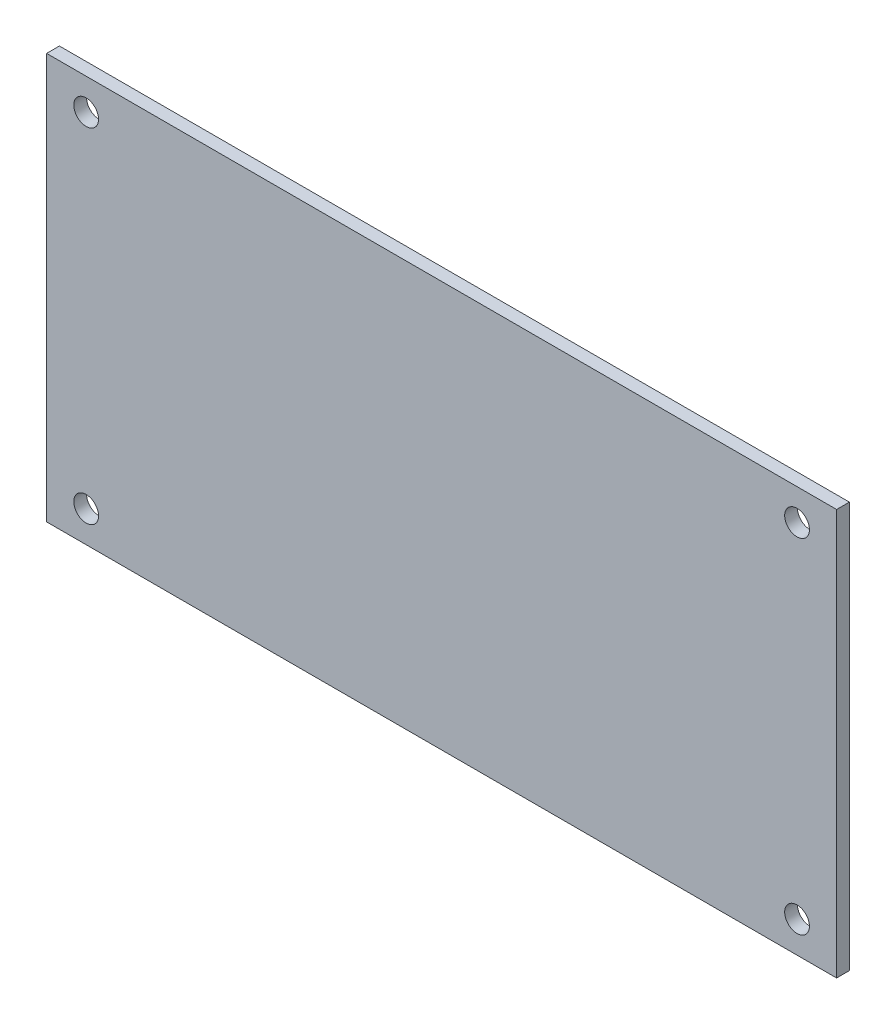
ISO-10303-21;
HEADER;
FILE_DESCRIPTION(('STEP AP214'),'2;1');
FILE_NAME('part.step','',(''),(''),'','','');
FILE_SCHEMA(('AUTOMOTIVE_DESIGN { 1 0 10303 214 1 1 1 1 }'));
ENDSEC;
DATA;
#1=APPLICATION_CONTEXT('core data for automotive mechanical design processes');
#2=APPLICATION_PROTOCOL_DEFINITION('international standard','automotive_design',2000,#1);
#3=PRODUCT_CONTEXT('',#1,'mechanical');
#4=PRODUCT('Part','Part','',(#3));
#5=PRODUCT_RELATED_PRODUCT_CATEGORY('part','',(#4));
#6=PRODUCT_DEFINITION_FORMATION('','',#4);
#7=PRODUCT_DEFINITION_CONTEXT('part definition',#1,'design');
#8=PRODUCT_DEFINITION('design','',#6,#7);
#9=PRODUCT_DEFINITION_SHAPE('','',#8);
#10=(LENGTH_UNIT() NAMED_UNIT(*) SI_UNIT(.MILLI.,.METRE.));
#11=(NAMED_UNIT(*) PLANE_ANGLE_UNIT() SI_UNIT($,.RADIAN.));
#12=(NAMED_UNIT(*) SI_UNIT($,.STERADIAN.) SOLID_ANGLE_UNIT());
#13=UNCERTAINTY_MEASURE_WITH_UNIT(LENGTH_MEASURE(1.E-05),#10,'distance_accuracy_value','');
#14=(GEOMETRIC_REPRESENTATION_CONTEXT(3) GLOBAL_UNCERTAINTY_ASSIGNED_CONTEXT((#13)) GLOBAL_UNIT_ASSIGNED_CONTEXT((#10,
#11,#12)) REPRESENTATION_CONTEXT('',''));
#15=CARTESIAN_POINT('',(0.,0.,0.));
#16=DIRECTION('',(0.,0.,1.));
#17=DIRECTION('',(1.,0.,0.));
#18=AXIS2_PLACEMENT_3D('',#15,#16,#17);
#19=CARTESIAN_POINT('',(0.,0.,1.6));
#20=DIRECTION('',(0.,0.,-1.));
#21=DIRECTION('',(-1.,0.,0.));
#22=AXIS2_PLACEMENT_3D('',#19,#20,#21);
#23=PLANE('',#22);
#24=CARTESIAN_POINT('',(44.5,-21.5,1.6));
#25=DIRECTION('',(0.,0.,1.));
#26=DIRECTION('',(1.,0.,0.));
#27=AXIS2_PLACEMENT_3D('',#24,#25,#26);
#28=CIRCLE('',#27,1.55);
#29=CARTESIAN_POINT('',(46.05,-21.5,1.6));
#30=VERTEX_POINT('',#29);
#31=EDGE_CURVE('E121',#30,#30,#28,.T.);
#32=ORIENTED_EDGE('',*,*,#31,.F.);
#33=EDGE_LOOP('',(#32));
#34=FACE_BOUND('',#33,.T.);
#35=CARTESIAN_POINT('',(-44.5,21.5,1.6));
#36=DIRECTION('',(0.,0.,1.));
#37=DIRECTION('',(1.,0.,0.));
#38=AXIS2_PLACEMENT_3D('',#35,#36,#37);
#39=CIRCLE('',#38,1.55);
#40=CARTESIAN_POINT('',(-42.95,21.5,1.6));
#41=VERTEX_POINT('',#40);
#42=EDGE_CURVE('E100',#41,#41,#39,.T.);
#43=ORIENTED_EDGE('',*,*,#42,.F.);
#44=EDGE_LOOP('',(#43));
#45=FACE_BOUND('',#44,.T.);
#46=DIRECTION('',(0.,-1.,0.));
#47=VECTOR('',#46,1.);
#48=CARTESIAN_POINT('',(-49.45,-25.4,1.6));
#49=LINE('',#48,#47);
#50=CARTESIAN_POINT('',(-49.45,25.4,1.6));
#51=VERTEX_POINT('',#50);
#52=CARTESIAN_POINT('',(-49.45,-25.4,1.6));
#53=VERTEX_POINT('',#52);
#54=EDGE_CURVE('E85',#51,#53,#49,.T.);
#55=ORIENTED_EDGE('',*,*,#54,.T.);
#56=DIRECTION('',(1.,0.,0.));
#57=VECTOR('',#56,1.);
#58=CARTESIAN_POINT('',(-49.45,-25.4,1.6));
#59=LINE('',#58,#57);
#60=CARTESIAN_POINT('',(49.45,-25.4,1.6));
#61=VERTEX_POINT('',#60);
#62=EDGE_CURVE('E80',#53,#61,#59,.T.);
#63=ORIENTED_EDGE('',*,*,#62,.T.);
#64=DIRECTION('',(0.,1.,0.));
#65=VECTOR('',#64,1.);
#66=CARTESIAN_POINT('',(49.45,-25.4,1.6));
#67=LINE('',#66,#65);
#68=CARTESIAN_POINT('',(49.45,25.4,1.6));
#69=VERTEX_POINT('',#68);
#70=EDGE_CURVE('E83',#61,#69,#67,.T.);
#71=ORIENTED_EDGE('',*,*,#70,.T.);
#72=DIRECTION('',(-1.,0.,0.));
#73=VECTOR('',#72,1.);
#74=CARTESIAN_POINT('',(-49.45,25.4,1.6));
#75=LINE('',#74,#73);
#76=EDGE_CURVE('E50',#69,#51,#75,.T.);
#77=ORIENTED_EDGE('',*,*,#76,.T.);
#78=EDGE_LOOP('',(#55,#63,#71,#77));
#79=FACE_BOUND('',#78,.T.);
#80=CARTESIAN_POINT('',(44.5,21.5,1.6));
#81=DIRECTION('',(0.,0.,1.));
#82=DIRECTION('',(1.,0.,0.));
#83=AXIS2_PLACEMENT_3D('',#80,#81,#82);
#84=CIRCLE('',#83,1.55);
#85=CARTESIAN_POINT('',(46.05,21.5,1.6));
#86=VERTEX_POINT('',#85);
#87=EDGE_CURVE('E115',#86,#86,#84,.T.);
#88=ORIENTED_EDGE('',*,*,#87,.F.);
#89=EDGE_LOOP('',(#88));
#90=FACE_BOUND('',#89,.T.);
#91=CARTESIAN_POINT('',(-44.5,-21.5,1.6));
#92=DIRECTION('',(0.,0.,1.));
#93=DIRECTION('',(1.,0.,0.));
#94=AXIS2_PLACEMENT_3D('',#91,#92,#93);
#95=CIRCLE('',#94,1.55);
#96=CARTESIAN_POINT('',(-42.95,-21.5,1.6));
#97=VERTEX_POINT('',#96);
#98=EDGE_CURVE('E127',#97,#97,#95,.T.);
#99=ORIENTED_EDGE('',*,*,#98,.F.);
#100=EDGE_LOOP('',(#99));
#101=FACE_BOUND('',#100,.T.);
#102=ADVANCED_FACE('F33',(#34,#45,#79,#90,#101),#23,.F.);
#103=CARTESIAN_POINT('',(0.,0.,0.));
#104=DIRECTION('',(0.,0.,-1.));
#105=DIRECTION('',(-1.,0.,0.));
#106=AXIS2_PLACEMENT_3D('',#103,#104,#105);
#107=PLANE('',#106);
#108=CARTESIAN_POINT('',(44.5,-21.5,0.));
#109=DIRECTION('',(0.,0.,1.));
#110=DIRECTION('',(1.,0.,0.));
#111=AXIS2_PLACEMENT_3D('',#108,#109,#110);
#112=CIRCLE('',#111,1.55);
#113=CARTESIAN_POINT('',(46.05,-21.5,0.));
#114=VERTEX_POINT('',#113);
#115=EDGE_CURVE('E124',#114,#114,#112,.T.);
#116=ORIENTED_EDGE('',*,*,#115,.T.);
#117=EDGE_LOOP('',(#116));
#118=FACE_BOUND('',#117,.T.);
#119=CARTESIAN_POINT('',(-44.5,21.5,0.));
#120=DIRECTION('',(0.,0.,1.));
#121=DIRECTION('',(1.,0.,0.));
#122=AXIS2_PLACEMENT_3D('',#119,#120,#121);
#123=CIRCLE('',#122,1.55);
#124=CARTESIAN_POINT('',(-42.95,21.5,0.));
#125=VERTEX_POINT('',#124);
#126=EDGE_CURVE('E112',#125,#125,#123,.T.);
#127=ORIENTED_EDGE('',*,*,#126,.T.);
#128=EDGE_LOOP('',(#127));
#129=FACE_BOUND('',#128,.T.);
#130=DIRECTION('',(0.,-1.,0.));
#131=VECTOR('',#130,1.);
#132=CARTESIAN_POINT('',(-49.45,-25.4,0.));
#133=LINE('',#132,#131);
#134=CARTESIAN_POINT('',(-49.45,25.4,0.));
#135=VERTEX_POINT('',#134);
#136=CARTESIAN_POINT('',(-49.45,-25.4,0.));
#137=VERTEX_POINT('',#136);
#138=EDGE_CURVE('E97',#135,#137,#133,.T.);
#139=ORIENTED_EDGE('',*,*,#138,.F.);
#140=DIRECTION('',(-1.,0.,0.));
#141=VECTOR('',#140,1.);
#142=CARTESIAN_POINT('',(-49.45,25.4,0.));
#143=LINE('',#142,#141);
#144=CARTESIAN_POINT('',(49.45,25.4,0.));
#145=VERTEX_POINT('',#144);
#146=EDGE_CURVE('E73',#145,#135,#143,.T.);
#147=ORIENTED_EDGE('',*,*,#146,.F.);
#148=DIRECTION('',(0.,1.,0.));
#149=VECTOR('',#148,1.);
#150=CARTESIAN_POINT('',(49.45,-25.4,0.));
#151=LINE('',#150,#149);
#152=CARTESIAN_POINT('',(49.45,-25.4,0.));
#153=VERTEX_POINT('',#152);
#154=EDGE_CURVE('E67',#153,#145,#151,.T.);
#155=ORIENTED_EDGE('',*,*,#154,.F.);
#156=DIRECTION('',(1.,0.,0.));
#157=VECTOR('',#156,1.);
#158=CARTESIAN_POINT('',(-49.45,-25.4,0.));
#159=LINE('',#158,#157);
#160=EDGE_CURVE('E89',#137,#153,#159,.T.);
#161=ORIENTED_EDGE('',*,*,#160,.F.);
#162=EDGE_LOOP('',(#139,#147,#155,#161));
#163=FACE_BOUND('',#162,.T.);
#164=CARTESIAN_POINT('',(44.5,21.5,0.));
#165=DIRECTION('',(0.,0.,1.));
#166=DIRECTION('',(1.,0.,0.));
#167=AXIS2_PLACEMENT_3D('',#164,#165,#166);
#168=CIRCLE('',#167,1.55);
#169=CARTESIAN_POINT('',(46.05,21.5,0.));
#170=VERTEX_POINT('',#169);
#171=EDGE_CURVE('E118',#170,#170,#168,.T.);
#172=ORIENTED_EDGE('',*,*,#171,.T.);
#173=EDGE_LOOP('',(#172));
#174=FACE_BOUND('',#173,.T.);
#175=CARTESIAN_POINT('',(-44.5,-21.5,0.));
#176=DIRECTION('',(0.,0.,1.));
#177=DIRECTION('',(1.,0.,0.));
#178=AXIS2_PLACEMENT_3D('',#175,#176,#177);
#179=CIRCLE('',#178,1.55);
#180=CARTESIAN_POINT('',(-42.95,-21.5,0.));
#181=VERTEX_POINT('',#180);
#182=EDGE_CURVE('E130',#181,#181,#179,.T.);
#183=ORIENTED_EDGE('',*,*,#182,.T.);
#184=EDGE_LOOP('',(#183));
#185=FACE_BOUND('',#184,.T.);
#186=ADVANCED_FACE('F108',(#118,#129,#163,#174,#185),#107,.T.);
#187=CARTESIAN_POINT('',(-49.45,-25.4,1.6));
#188=DIRECTION('',(1.,0.,0.));
#189=DIRECTION('',(0.,0.,-1.));
#190=AXIS2_PLACEMENT_3D('',#187,#188,#189);
#191=PLANE('',#190);
#192=ORIENTED_EDGE('',*,*,#138,.T.);
#193=DIRECTION('',(0.,0.,-1.));
#194=VECTOR('',#193,1.);
#195=CARTESIAN_POINT('',(-49.45,-25.4,1.6));
#196=LINE('',#195,#194);
#197=EDGE_CURVE('E11',#53,#137,#196,.T.);
#198=ORIENTED_EDGE('',*,*,#197,.F.);
#199=ORIENTED_EDGE('',*,*,#54,.F.);
#200=DIRECTION('',(0.,0.,-1.));
#201=VECTOR('',#200,1.);
#202=CARTESIAN_POINT('',(-49.45,25.4,1.6));
#203=LINE('',#202,#201);
#204=EDGE_CURVE('E93',#51,#135,#203,.T.);
#205=ORIENTED_EDGE('',*,*,#204,.T.);
#206=EDGE_LOOP('',(#192,#198,#199,#205));
#207=FACE_BOUND('',#206,.T.);
#208=ADVANCED_FACE('F35',(#207),#191,.F.);
#209=CARTESIAN_POINT('',(-49.45,-25.4,1.6));
#210=DIRECTION('',(0.,1.,0.));
#211=DIRECTION('',(-1.,0.,0.));
#212=AXIS2_PLACEMENT_3D('',#209,#210,#211);
#213=PLANE('',#212);
#214=ORIENTED_EDGE('',*,*,#160,.T.);
#215=DIRECTION('',(0.,0.,-1.));
#216=VECTOR('',#215,1.);
#217=CARTESIAN_POINT('',(49.45,-25.4,1.6));
#218=LINE('',#217,#216);
#219=EDGE_CURVE('E42',#61,#153,#218,.T.);
#220=ORIENTED_EDGE('',*,*,#219,.F.);
#221=ORIENTED_EDGE('',*,*,#62,.F.);
#222=ORIENTED_EDGE('',*,*,#197,.T.);
#223=EDGE_LOOP('',(#214,#220,#221,#222));
#224=FACE_BOUND('',#223,.T.);
#225=ADVANCED_FACE('F88',(#224),#213,.F.);
#226=CARTESIAN_POINT('',(49.45,-25.4,1.6));
#227=DIRECTION('',(-1.,0.,0.));
#228=DIRECTION('',(0.,0.,1.));
#229=AXIS2_PLACEMENT_3D('',#226,#227,#228);
#230=PLANE('',#229);
#231=ORIENTED_EDGE('',*,*,#154,.T.);
#232=DIRECTION('',(0.,0.,-1.));
#233=VECTOR('',#232,1.);
#234=CARTESIAN_POINT('',(49.45,25.4,1.6));
#235=LINE('',#234,#233);
#236=EDGE_CURVE('E90',#69,#145,#235,.T.);
#237=ORIENTED_EDGE('',*,*,#236,.F.);
#238=ORIENTED_EDGE('',*,*,#70,.F.);
#239=ORIENTED_EDGE('',*,*,#219,.T.);
#240=EDGE_LOOP('',(#231,#237,#238,#239));
#241=FACE_BOUND('',#240,.T.);
#242=ADVANCED_FACE('F91',(#241),#230,.F.);
#243=CARTESIAN_POINT('',(-49.45,25.4,1.6));
#244=DIRECTION('',(0.,-1.,0.));
#245=DIRECTION('',(1.,0.,0.));
#246=AXIS2_PLACEMENT_3D('',#243,#244,#245);
#247=PLANE('',#246);
#248=ORIENTED_EDGE('',*,*,#146,.T.);
#249=ORIENTED_EDGE('',*,*,#204,.F.);
#250=ORIENTED_EDGE('',*,*,#76,.F.);
#251=ORIENTED_EDGE('',*,*,#236,.T.);
#252=EDGE_LOOP('',(#248,#249,#250,#251));
#253=FACE_BOUND('',#252,.T.);
#254=ADVANCED_FACE('F105',(#253),#247,.F.);
#255=CARTESIAN_POINT('',(-44.5,21.5,1.6));
#256=DIRECTION('',(0.,0.,-1.));
#257=DIRECTION('',(-1.,0.,0.));
#258=AXIS2_PLACEMENT_3D('',#255,#256,#257);
#259=CYLINDRICAL_SURFACE('',#258,1.55);
#260=ORIENTED_EDGE('',*,*,#42,.T.);
#261=EDGE_LOOP('',(#260));
#262=FACE_BOUND('',#261,.T.);
#263=ORIENTED_EDGE('',*,*,#126,.F.);
#264=EDGE_LOOP('',(#263));
#265=FACE_BOUND('',#264,.T.);
#266=ADVANCED_FACE('F150',(#262,#265),#259,.F.);
#267=CARTESIAN_POINT('',(44.5,21.5,1.6));
#268=DIRECTION('',(0.,0.,-1.));
#269=DIRECTION('',(-1.,0.,0.));
#270=AXIS2_PLACEMENT_3D('',#267,#268,#269);
#271=CYLINDRICAL_SURFACE('',#270,1.55);
#272=ORIENTED_EDGE('',*,*,#87,.T.);
#273=EDGE_LOOP('',(#272));
#274=FACE_BOUND('',#273,.T.);
#275=ORIENTED_EDGE('',*,*,#171,.F.);
#276=EDGE_LOOP('',(#275));
#277=FACE_BOUND('',#276,.T.);
#278=ADVANCED_FACE('F196',(#274,#277),#271,.F.);
#279=CARTESIAN_POINT('',(44.5,-21.5,1.6));
#280=DIRECTION('',(0.,0.,-1.));
#281=DIRECTION('',(-1.,0.,0.));
#282=AXIS2_PLACEMENT_3D('',#279,#280,#281);
#283=CYLINDRICAL_SURFACE('',#282,1.55);
#284=ORIENTED_EDGE('',*,*,#31,.T.);
#285=EDGE_LOOP('',(#284));
#286=FACE_BOUND('',#285,.T.);
#287=ORIENTED_EDGE('',*,*,#115,.F.);
#288=EDGE_LOOP('',(#287));
#289=FACE_BOUND('',#288,.T.);
#290=ADVANCED_FACE('F204',(#286,#289),#283,.F.);
#291=CARTESIAN_POINT('',(-44.5,-21.5,1.6));
#292=DIRECTION('',(0.,0.,-1.));
#293=DIRECTION('',(-1.,0.,0.));
#294=AXIS2_PLACEMENT_3D('',#291,#292,#293);
#295=CYLINDRICAL_SURFACE('',#294,1.55);
#296=ORIENTED_EDGE('',*,*,#98,.T.);
#297=EDGE_LOOP('',(#296));
#298=FACE_BOUND('',#297,.T.);
#299=ORIENTED_EDGE('',*,*,#182,.F.);
#300=EDGE_LOOP('',(#299));
#301=FACE_BOUND('',#300,.T.);
#302=ADVANCED_FACE('F136',(#298,#301),#295,.F.);
#303=CLOSED_SHELL('',(#102,#186,#208,#225,#242,#254,#266,#278,#290,#302));
#304=MANIFOLD_SOLID_BREP('B2',#303);
#305=ADVANCED_BREP_SHAPE_REPRESENTATION('',(#18,#304),#14);
#306=SHAPE_DEFINITION_REPRESENTATION(#9,#305);
ENDSEC;
END-ISO-10303-21;
